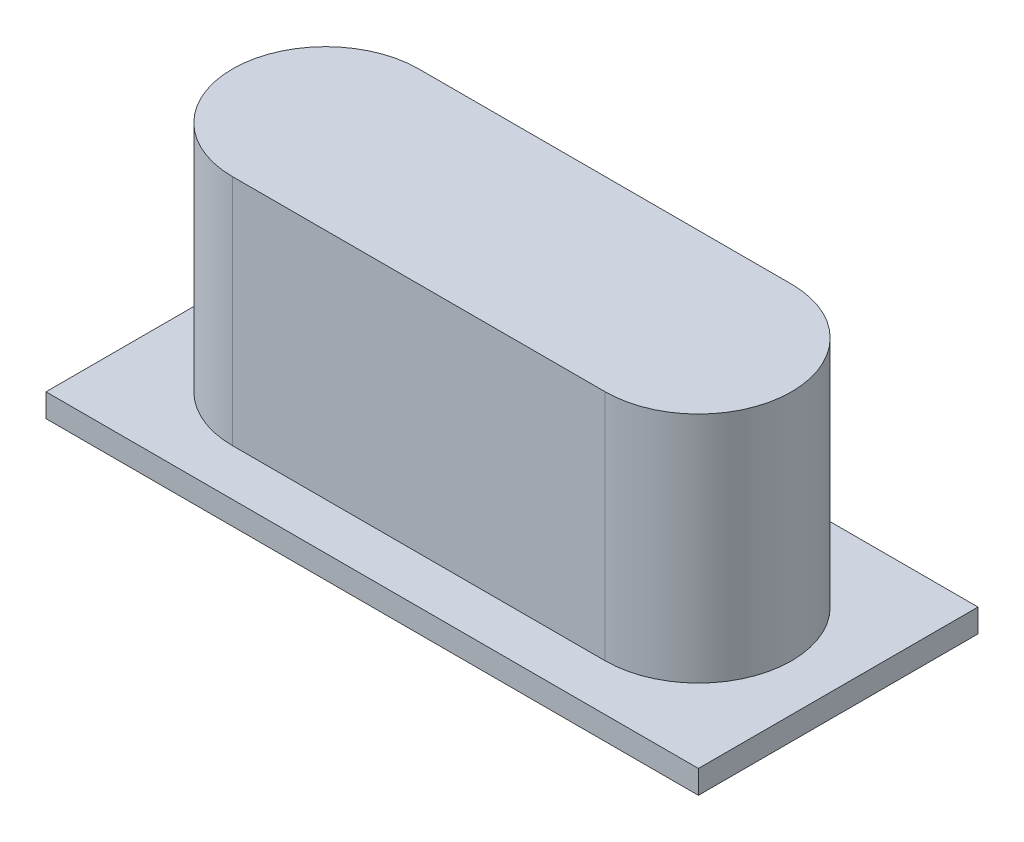
ISO-10303-21;
HEADER;
FILE_DESCRIPTION(('STEP AP214'),'2;1');
FILE_NAME('part.step','',(''),(''),'','','');
FILE_SCHEMA(('AUTOMOTIVE_DESIGN { 1 0 10303 214 1 1 1 1 }'));
ENDSEC;
DATA;
#1=APPLICATION_CONTEXT('core data for automotive mechanical design processes');
#2=APPLICATION_PROTOCOL_DEFINITION('international standard','automotive_design',2000,#1);
#3=PRODUCT_CONTEXT('',#1,'mechanical');
#4=PRODUCT('Part','Part','',(#3));
#5=PRODUCT_RELATED_PRODUCT_CATEGORY('part','',(#4));
#6=PRODUCT_DEFINITION_FORMATION('','',#4);
#7=PRODUCT_DEFINITION_CONTEXT('part definition',#1,'design');
#8=PRODUCT_DEFINITION('design','',#6,#7);
#9=PRODUCT_DEFINITION_SHAPE('','',#8);
#10=(LENGTH_UNIT() NAMED_UNIT(*) SI_UNIT(.MILLI.,.METRE.));
#11=(NAMED_UNIT(*) PLANE_ANGLE_UNIT() SI_UNIT($,.RADIAN.));
#12=(NAMED_UNIT(*) SI_UNIT($,.STERADIAN.) SOLID_ANGLE_UNIT());
#13=UNCERTAINTY_MEASURE_WITH_UNIT(LENGTH_MEASURE(1.E-05),#10,'distance_accuracy_value','');
#14=(GEOMETRIC_REPRESENTATION_CONTEXT(3) GLOBAL_UNCERTAINTY_ASSIGNED_CONTEXT((#13)) GLOBAL_UNIT_ASSIGNED_CONTEXT((#10,
#11,#12)) REPRESENTATION_CONTEXT('',''));
#15=CARTESIAN_POINT('',(0.,0.,0.));
#16=DIRECTION('',(0.,0.,1.));
#17=DIRECTION('',(1.,0.,0.));
#18=AXIS2_PLACEMENT_3D('',#15,#16,#17);
#19=CARTESIAN_POINT('',(0.,0.25,0.));
#20=DIRECTION('',(0.,-1.,0.));
#21=DIRECTION('',(0.,0.,-1.));
#22=AXIS2_PLACEMENT_3D('',#19,#20,#21);
#23=PLANE('',#22);
#24=DIRECTION('',(0.,0.,-1.));
#25=VECTOR('',#24,1.);
#26=CARTESIAN_POINT('',(3.5,0.25,1.5));
#27=LINE('',#26,#25);
#28=CARTESIAN_POINT('',(3.5,0.25,1.5));
#29=VERTEX_POINT('',#28);
#30=CARTESIAN_POINT('',(3.5,0.25,-1.5));
#31=VERTEX_POINT('',#30);
#32=EDGE_CURVE('E127',#29,#31,#27,.T.);
#33=ORIENTED_EDGE('',*,*,#32,.T.);
#34=DIRECTION('',(-1.,0.,0.));
#35=VECTOR('',#34,1.);
#36=CARTESIAN_POINT('',(-3.5,0.25,-1.5));
#37=LINE('',#36,#35);
#38=CARTESIAN_POINT('',(-3.5,0.25,-1.5));
#39=VERTEX_POINT('',#38);
#40=EDGE_CURVE('E130',#31,#39,#37,.T.);
#41=ORIENTED_EDGE('',*,*,#40,.T.);
#42=DIRECTION('',(0.,0.,1.));
#43=VECTOR('',#42,1.);
#44=CARTESIAN_POINT('',(-3.5,0.25,1.5));
#45=LINE('',#44,#43);
#46=CARTESIAN_POINT('',(-3.5,0.25,1.5));
#47=VERTEX_POINT('',#46);
#48=EDGE_CURVE('E133',#39,#47,#45,.T.);
#49=ORIENTED_EDGE('',*,*,#48,.T.);
#50=DIRECTION('',(1.,0.,0.));
#51=VECTOR('',#50,1.);
#52=CARTESIAN_POINT('',(-3.5,0.25,1.5));
#53=LINE('',#52,#51);
#54=EDGE_CURVE('E135',#47,#29,#53,.T.);
#55=ORIENTED_EDGE('',*,*,#54,.T.);
#56=EDGE_LOOP('',(#33,#41,#49,#55));
#57=FACE_BOUND('',#56,.T.);
#58=CARTESIAN_POINT('',(2.,0.25,0.));
#59=DIRECTION('',(0.,1.,0.));
#60=DIRECTION('',(0.,0.,1.));
#61=AXIS2_PLACEMENT_3D('',#58,#59,#60);
#62=CIRCLE('',#61,1.);
#63=CARTESIAN_POINT('',(2.,0.25,0.999999999999999));
#64=VERTEX_POINT('',#63);
#65=CARTESIAN_POINT('',(2.,0.25,-1.));
#66=VERTEX_POINT('',#65);
#67=EDGE_CURVE('E48',#64,#66,#62,.T.);
#68=ORIENTED_EDGE('',*,*,#67,.F.);
#69=DIRECTION('',(1.,0.,0.));
#70=VECTOR('',#69,1.);
#71=CARTESIAN_POINT('',(2.,0.25,0.999999999999999));
#72=LINE('',#71,#70);
#73=CARTESIAN_POINT('',(-2.,0.25,1.));
#74=VERTEX_POINT('',#73);
#75=EDGE_CURVE('E52',#74,#64,#72,.T.);
#76=ORIENTED_EDGE('',*,*,#75,.F.);
#77=CARTESIAN_POINT('',(-2.,0.25,0.));
#78=DIRECTION('',(0.,1.,0.));
#79=DIRECTION('',(0.,0.,1.));
#80=AXIS2_PLACEMENT_3D('',#77,#78,#79);
#81=CIRCLE('',#80,1.);
#82=CARTESIAN_POINT('',(-2.,0.25,-1.));
#83=VERTEX_POINT('',#82);
#84=EDGE_CURVE('E260',#83,#74,#81,.T.);
#85=ORIENTED_EDGE('',*,*,#84,.F.);
#86=DIRECTION('',(-1.,0.,0.));
#87=VECTOR('',#86,1.);
#88=CARTESIAN_POINT('',(2.,0.25,-1.));
#89=LINE('',#88,#87);
#90=EDGE_CURVE('E266',#66,#83,#89,.T.);
#91=ORIENTED_EDGE('',*,*,#90,.F.);
#92=EDGE_LOOP('',(#68,#76,#85,#91));
#93=FACE_BOUND('',#92,.T.);
#94=ADVANCED_FACE('F33',(#57,#93),#23,.F.);
#95=CARTESIAN_POINT('',(3.5,0.25,1.5));
#96=DIRECTION('',(-1.,0.,0.));
#97=DIRECTION('',(0.,0.,1.));
#98=AXIS2_PLACEMENT_3D('',#95,#96,#97);
#99=PLANE('',#98);
#100=DIRECTION('',(0.,0.,-1.));
#101=VECTOR('',#100,1.);
#102=CARTESIAN_POINT('',(3.5,0.,1.5));
#103=LINE('',#102,#101);
#104=CARTESIAN_POINT('',(3.5,0.,1.5));
#105=VERTEX_POINT('',#104);
#106=CARTESIAN_POINT('',(3.5,0.,-1.5));
#107=VERTEX_POINT('',#106);
#108=EDGE_CURVE('E118',#105,#107,#103,.T.);
#109=ORIENTED_EDGE('',*,*,#108,.T.);
#110=DIRECTION('',(0.,-1.,0.));
#111=VECTOR('',#110,1.);
#112=CARTESIAN_POINT('',(3.5,0.25,-1.5));
#113=LINE('',#112,#111);
#114=EDGE_CURVE('E11',#31,#107,#113,.T.);
#115=ORIENTED_EDGE('',*,*,#114,.F.);
#116=ORIENTED_EDGE('',*,*,#32,.F.);
#117=DIRECTION('',(0.,-1.,0.));
#118=VECTOR('',#117,1.);
#119=CARTESIAN_POINT('',(3.5,0.25,1.5));
#120=LINE('',#119,#118);
#121=EDGE_CURVE('E136',#29,#105,#120,.T.);
#122=ORIENTED_EDGE('',*,*,#121,.T.);
#123=EDGE_LOOP('',(#109,#115,#116,#122));
#124=FACE_BOUND('',#123,.T.);
#125=ADVANCED_FACE('F35',(#124),#99,.F.);
#126=CARTESIAN_POINT('',(-3.5,0.25,-1.5));
#127=DIRECTION('',(0.,0.,1.));
#128=DIRECTION('',(1.,0.,0.));
#129=AXIS2_PLACEMENT_3D('',#126,#127,#128);
#130=PLANE('',#129);
#131=DIRECTION('',(-1.,0.,0.));
#132=VECTOR('',#131,1.);
#133=CARTESIAN_POINT('',(-3.5,0.,-1.5));
#134=LINE('',#133,#132);
#135=CARTESIAN_POINT('',(-3.5,0.,-1.5));
#136=VERTEX_POINT('',#135);
#137=EDGE_CURVE('E121',#107,#136,#134,.T.);
#138=ORIENTED_EDGE('',*,*,#137,.T.);
#139=DIRECTION('',(0.,-1.,0.));
#140=VECTOR('',#139,1.);
#141=CARTESIAN_POINT('',(-3.5,0.25,-1.5));
#142=LINE('',#141,#140);
#143=EDGE_CURVE('E41',#39,#136,#142,.T.);
#144=ORIENTED_EDGE('',*,*,#143,.F.);
#145=ORIENTED_EDGE('',*,*,#40,.F.);
#146=ORIENTED_EDGE('',*,*,#114,.T.);
#147=EDGE_LOOP('',(#138,#144,#145,#146));
#148=FACE_BOUND('',#147,.T.);
#149=ADVANCED_FACE('F166',(#148),#130,.F.);
#150=CARTESIAN_POINT('',(-3.5,0.25,1.5));
#151=DIRECTION('',(1.,0.,0.));
#152=DIRECTION('',(0.,0.,-1.));
#153=AXIS2_PLACEMENT_3D('',#150,#151,#152);
#154=PLANE('',#153);
#155=DIRECTION('',(0.,0.,1.));
#156=VECTOR('',#155,1.);
#157=CARTESIAN_POINT('',(-3.5,0.,1.5));
#158=LINE('',#157,#156);
#159=CARTESIAN_POINT('',(-3.5,0.,1.5));
#160=VERTEX_POINT('',#159);
#161=EDGE_CURVE('E139',#136,#160,#158,.T.);
#162=ORIENTED_EDGE('',*,*,#161,.T.);
#163=DIRECTION('',(0.,-1.,0.));
#164=VECTOR('',#163,1.);
#165=CARTESIAN_POINT('',(-3.5,0.25,1.5));
#166=LINE('',#165,#164);
#167=EDGE_CURVE('E144',#47,#160,#166,.T.);
#168=ORIENTED_EDGE('',*,*,#167,.F.);
#169=ORIENTED_EDGE('',*,*,#48,.F.);
#170=ORIENTED_EDGE('',*,*,#143,.T.);
#171=EDGE_LOOP('',(#162,#168,#169,#170));
#172=FACE_BOUND('',#171,.T.);
#173=ADVANCED_FACE('F151',(#172),#154,.F.);
#174=CARTESIAN_POINT('',(-3.5,0.25,1.5));
#175=DIRECTION('',(0.,0.,-1.));
#176=DIRECTION('',(-1.,0.,0.));
#177=AXIS2_PLACEMENT_3D('',#174,#175,#176);
#178=PLANE('',#177);
#179=DIRECTION('',(1.,0.,0.));
#180=VECTOR('',#179,1.);
#181=CARTESIAN_POINT('',(-3.5,0.,1.5));
#182=LINE('',#181,#180);
#183=EDGE_CURVE('E131',#160,#105,#182,.T.);
#184=ORIENTED_EDGE('',*,*,#183,.T.);
#185=ORIENTED_EDGE('',*,*,#121,.F.);
#186=ORIENTED_EDGE('',*,*,#54,.F.);
#187=ORIENTED_EDGE('',*,*,#167,.T.);
#188=EDGE_LOOP('',(#184,#185,#186,#187));
#189=FACE_BOUND('',#188,.T.);
#190=ADVANCED_FACE('F160',(#189),#178,.F.);
#191=CARTESIAN_POINT('',(0.,0.,0.));
#192=DIRECTION('',(0.,-1.,0.));
#193=DIRECTION('',(0.,0.,-1.));
#194=AXIS2_PLACEMENT_3D('',#191,#192,#193);
#195=PLANE('',#194);
#196=ORIENTED_EDGE('',*,*,#108,.F.);
#197=ORIENTED_EDGE('',*,*,#183,.F.);
#198=ORIENTED_EDGE('',*,*,#161,.F.);
#199=ORIENTED_EDGE('',*,*,#137,.F.);
#200=EDGE_LOOP('',(#196,#197,#198,#199));
#201=FACE_BOUND('',#200,.T.);
#202=ADVANCED_FACE('F157',(#201),#195,.T.);
#203=CARTESIAN_POINT('',(2.,2.75,0.));
#204=DIRECTION('',(0.,-1.,0.));
#205=DIRECTION('',(0.,0.,-1.));
#206=AXIS2_PLACEMENT_3D('',#203,#204,#205);
#207=CYLINDRICAL_SURFACE('',#206,1.);
#208=ORIENTED_EDGE('',*,*,#67,.T.);
#209=DIRECTION('',(0.,-1.,0.));
#210=VECTOR('',#209,1.);
#211=CARTESIAN_POINT('',(2.,2.75,-1.));
#212=LINE('',#211,#210);
#213=CARTESIAN_POINT('',(2.,2.75,-1.));
#214=VERTEX_POINT('',#213);
#215=EDGE_CURVE('E101',#214,#66,#212,.T.);
#216=ORIENTED_EDGE('',*,*,#215,.F.);
#217=CARTESIAN_POINT('',(2.,2.75,0.));
#218=DIRECTION('',(0.,1.,0.));
#219=DIRECTION('',(0.,0.,1.));
#220=AXIS2_PLACEMENT_3D('',#217,#218,#219);
#221=CIRCLE('',#220,1.);
#222=CARTESIAN_POINT('',(2.,2.75,0.999999999999999));
#223=VERTEX_POINT('',#222);
#224=EDGE_CURVE('E107',#223,#214,#221,.T.);
#225=ORIENTED_EDGE('',*,*,#224,.F.);
#226=DIRECTION('',(0.,-1.,0.));
#227=VECTOR('',#226,1.);
#228=CARTESIAN_POINT('',(2.,2.75,0.999999999999999));
#229=LINE('',#228,#227);
#230=EDGE_CURVE('E258',#223,#64,#229,.T.);
#231=ORIENTED_EDGE('',*,*,#230,.T.);
#232=EDGE_LOOP('',(#208,#216,#225,#231));
#233=FACE_BOUND('',#232,.T.);
#234=ADVANCED_FACE('F117',(#233),#207,.T.);
#235=CARTESIAN_POINT('',(2.,2.75,-1.));
#236=DIRECTION('',(0.,0.,1.));
#237=DIRECTION('',(1.,0.,0.));
#238=AXIS2_PLACEMENT_3D('',#235,#236,#237);
#239=PLANE('',#238);
#240=ORIENTED_EDGE('',*,*,#90,.T.);
#241=DIRECTION('',(0.,-1.,0.));
#242=VECTOR('',#241,1.);
#243=CARTESIAN_POINT('',(-2.,2.75,-1.));
#244=LINE('',#243,#242);
#245=CARTESIAN_POINT('',(-2.,2.75,-1.));
#246=VERTEX_POINT('',#245);
#247=EDGE_CURVE('E103',#246,#83,#244,.T.);
#248=ORIENTED_EDGE('',*,*,#247,.F.);
#249=DIRECTION('',(-1.,0.,0.));
#250=VECTOR('',#249,1.);
#251=CARTESIAN_POINT('',(2.,2.75,-1.));
#252=LINE('',#251,#250);
#253=EDGE_CURVE('E96',#214,#246,#252,.T.);
#254=ORIENTED_EDGE('',*,*,#253,.F.);
#255=ORIENTED_EDGE('',*,*,#215,.T.);
#256=EDGE_LOOP('',(#240,#248,#254,#255));
#257=FACE_BOUND('',#256,.T.);
#258=ADVANCED_FACE('F99',(#257),#239,.F.);
#259=CARTESIAN_POINT('',(-2.,2.75,0.));
#260=DIRECTION('',(0.,-1.,0.));
#261=DIRECTION('',(0.,0.,-1.));
#262=AXIS2_PLACEMENT_3D('',#259,#260,#261);
#263=CYLINDRICAL_SURFACE('',#262,1.);
#264=ORIENTED_EDGE('',*,*,#84,.T.);
#265=DIRECTION('',(0.,-1.,0.));
#266=VECTOR('',#265,1.);
#267=CARTESIAN_POINT('',(-2.,2.75,1.));
#268=LINE('',#267,#266);
#269=CARTESIAN_POINT('',(-2.,2.75,1.));
#270=VERTEX_POINT('',#269);
#271=EDGE_CURVE('E123',#270,#74,#268,.T.);
#272=ORIENTED_EDGE('',*,*,#271,.F.);
#273=CARTESIAN_POINT('',(-2.,2.75,0.));
#274=DIRECTION('',(0.,1.,0.));
#275=DIRECTION('',(0.,0.,1.));
#276=AXIS2_PLACEMENT_3D('',#273,#274,#275);
#277=CIRCLE('',#276,1.);
#278=EDGE_CURVE('E106',#246,#270,#277,.T.);
#279=ORIENTED_EDGE('',*,*,#278,.F.);
#280=ORIENTED_EDGE('',*,*,#247,.T.);
#281=EDGE_LOOP('',(#264,#272,#279,#280));
#282=FACE_BOUND('',#281,.T.);
#283=ADVANCED_FACE('F202',(#282),#263,.T.);
#284=CARTESIAN_POINT('',(2.,2.75,0.999999999999999));
#285=DIRECTION('',(0.,0.,-1.));
#286=DIRECTION('',(-1.,0.,0.));
#287=AXIS2_PLACEMENT_3D('',#284,#285,#286);
#288=PLANE('',#287);
#289=ORIENTED_EDGE('',*,*,#75,.T.);
#290=ORIENTED_EDGE('',*,*,#230,.F.);
#291=DIRECTION('',(1.,0.,0.));
#292=VECTOR('',#291,1.);
#293=CARTESIAN_POINT('',(2.,2.75,0.999999999999999));
#294=LINE('',#293,#292);
#295=EDGE_CURVE('E112',#270,#223,#294,.T.);
#296=ORIENTED_EDGE('',*,*,#295,.F.);
#297=ORIENTED_EDGE('',*,*,#271,.T.);
#298=EDGE_LOOP('',(#289,#290,#296,#297));
#299=FACE_BOUND('',#298,.T.);
#300=ADVANCED_FACE('F208',(#299),#288,.F.);
#301=CARTESIAN_POINT('',(2.,2.75,0.));
#302=DIRECTION('',(0.,1.,0.));
#303=DIRECTION('',(0.,0.,1.));
#304=AXIS2_PLACEMENT_3D('',#301,#302,#303);
#305=PLANE('',#304);
#306=ORIENTED_EDGE('',*,*,#224,.T.);
#307=ORIENTED_EDGE('',*,*,#253,.T.);
#308=ORIENTED_EDGE('',*,*,#278,.T.);
#309=ORIENTED_EDGE('',*,*,#295,.T.);
#310=EDGE_LOOP('',(#306,#307,#308,#309));
#311=FACE_BOUND('',#310,.T.);
#312=ADVANCED_FACE('F110',(#311),#305,.T.);
#313=CLOSED_SHELL('',(#94,#125,#149,#173,#190,#202,#234,#258,#283,#300,#312));
#314=MANIFOLD_SOLID_BREP('B2',#313);
#315=ADVANCED_BREP_SHAPE_REPRESENTATION('',(#18,#314),#14);
#316=SHAPE_DEFINITION_REPRESENTATION(#9,#315);
ENDSEC;
END-ISO-10303-21;
